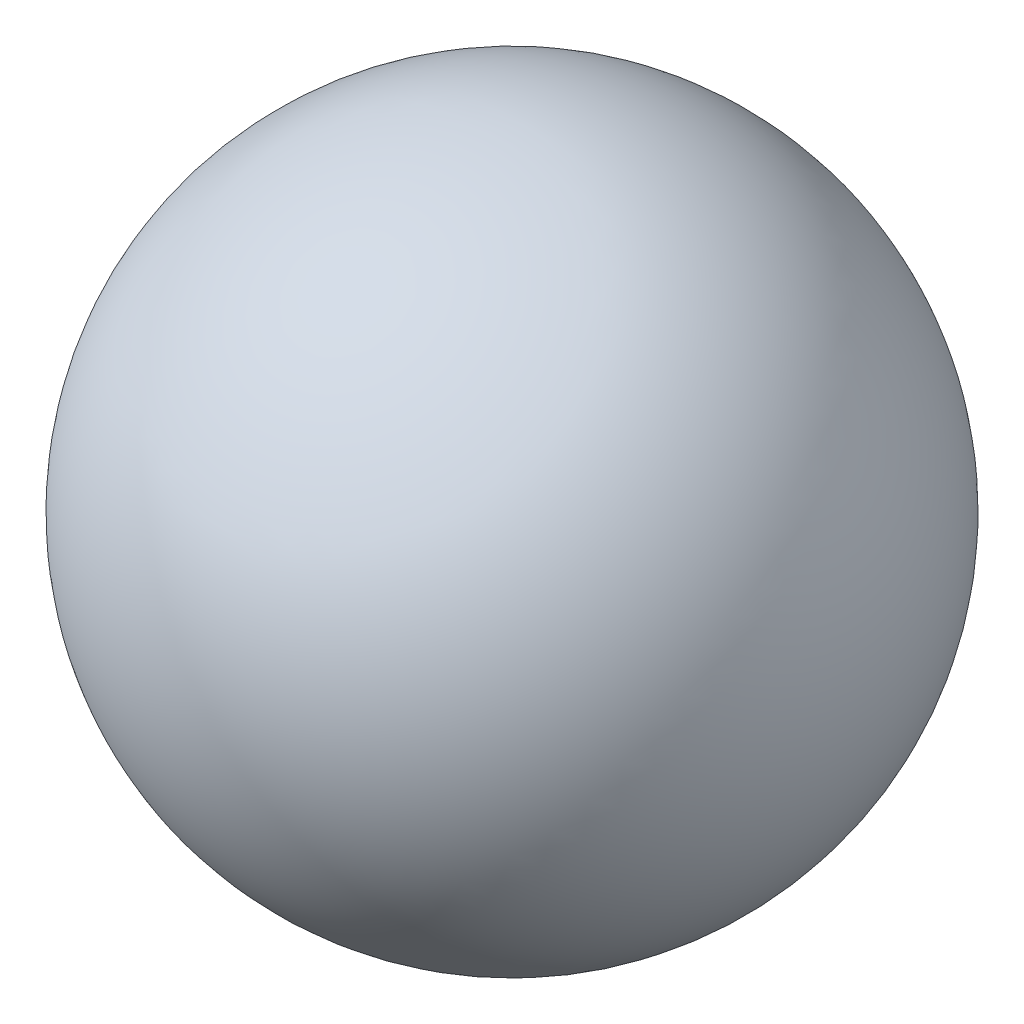
ISO-10303-21;
HEADER;
FILE_DESCRIPTION(('STEP AP214'),'2;1');
FILE_NAME('part.step','',(''),(''),'','','');
FILE_SCHEMA(('AUTOMOTIVE_DESIGN { 1 0 10303 214 1 1 1 1 }'));
ENDSEC;
DATA;
#1=APPLICATION_CONTEXT('core data for automotive mechanical design processes');
#2=APPLICATION_PROTOCOL_DEFINITION('international standard','automotive_design',2000,#1);
#3=PRODUCT_CONTEXT('',#1,'mechanical');
#4=PRODUCT('Part','Part','',(#3));
#5=PRODUCT_RELATED_PRODUCT_CATEGORY('part','',(#4));
#6=PRODUCT_DEFINITION_FORMATION('','',#4);
#7=PRODUCT_DEFINITION_CONTEXT('part definition',#1,'design');
#8=PRODUCT_DEFINITION('design','',#6,#7);
#9=PRODUCT_DEFINITION_SHAPE('','',#8);
#10=(LENGTH_UNIT() NAMED_UNIT(*) SI_UNIT(.MILLI.,.METRE.));
#11=(NAMED_UNIT(*) PLANE_ANGLE_UNIT() SI_UNIT($,.RADIAN.));
#12=(NAMED_UNIT(*) SI_UNIT($,.STERADIAN.) SOLID_ANGLE_UNIT());
#13=UNCERTAINTY_MEASURE_WITH_UNIT(LENGTH_MEASURE(1.E-05),#10,'distance_accuracy_value','');
#14=(GEOMETRIC_REPRESENTATION_CONTEXT(3) GLOBAL_UNCERTAINTY_ASSIGNED_CONTEXT((#13)) GLOBAL_UNIT_ASSIGNED_CONTEXT((#10,
#11,#12)) REPRESENTATION_CONTEXT('',''));
#15=CARTESIAN_POINT('',(0.,0.,0.));
#16=DIRECTION('',(0.,0.,1.));
#17=DIRECTION('',(1.,0.,0.));
#18=AXIS2_PLACEMENT_3D('',#15,#16,#17);
#19=CARTESIAN_POINT('',(1.11690850882415,-2.,-11.6967950902337));
#20=DIRECTION('',(0.,0.,1.));
#21=DIRECTION('',(1.,0.,0.));
#22=AXIS2_PLACEMENT_3D('',#19,#20,#21);
#23=SPHERICAL_SURFACE('',#22,1.05);
#24=CARTESIAN_POINT('',(1.11690850882415,-2.,-10.6467950902337));
#25=VERTEX_POINT('',#24);
#26=VERTEX_LOOP('',#25);
#27=FACE_BOUND('',#26,.T.);
#28=ADVANCED_FACE('F13',(#27),#23,.T.);
#29=CLOSED_SHELL('',(#28));
#30=MANIFOLD_SOLID_BREP('B1',#29);
#31=ADVANCED_BREP_SHAPE_REPRESENTATION('',(#18,#30),#14);
#32=SHAPE_DEFINITION_REPRESENTATION(#9,#31);
ENDSEC;
END-ISO-10303-21;
